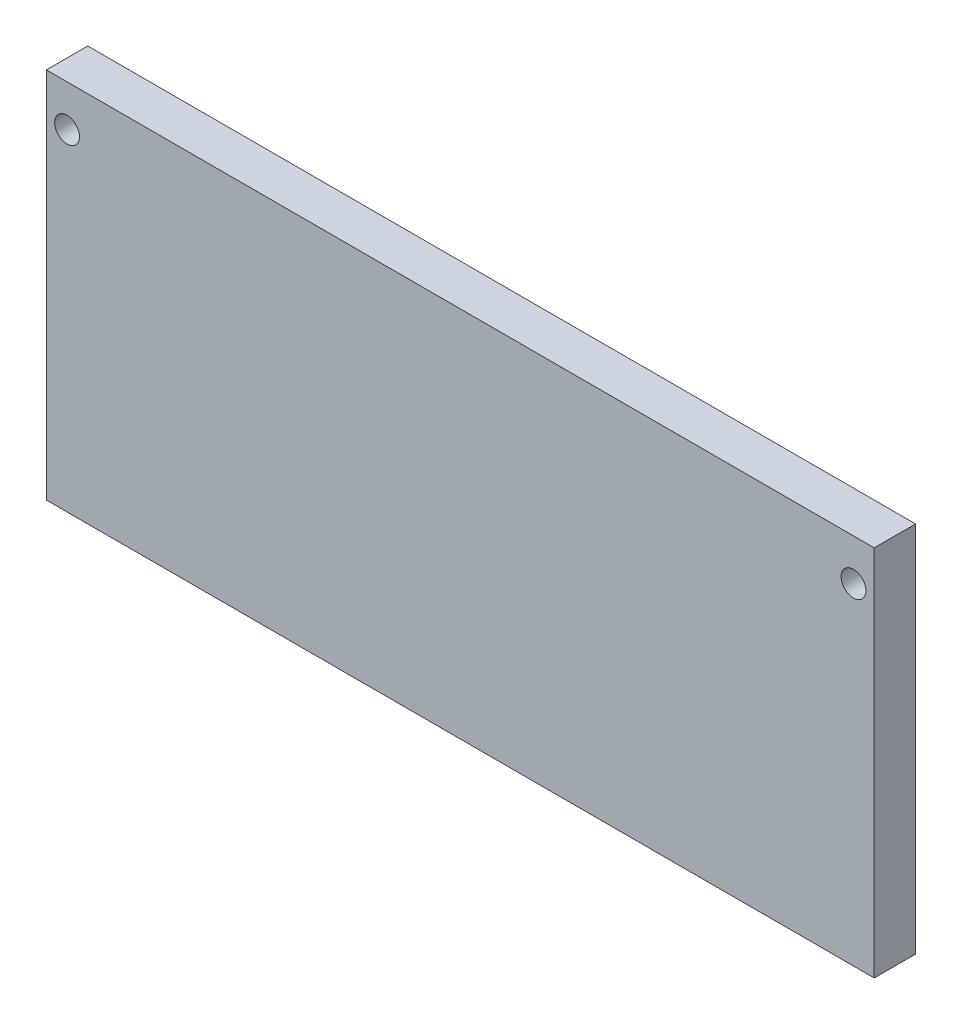
ISO-10303-21;
HEADER;
FILE_DESCRIPTION(('STEP AP214'),'2;1');
FILE_NAME('part.step','',(''),(''),'','','');
FILE_SCHEMA(('AUTOMOTIVE_DESIGN { 1 0 10303 214 1 1 1 1 }'));
ENDSEC;
DATA;
#1=APPLICATION_CONTEXT('core data for automotive mechanical design processes');
#2=APPLICATION_PROTOCOL_DEFINITION('international standard','automotive_design',2000,#1);
#3=PRODUCT_CONTEXT('',#1,'mechanical');
#4=PRODUCT('Part','Part','',(#3));
#5=PRODUCT_RELATED_PRODUCT_CATEGORY('part','',(#4));
#6=PRODUCT_DEFINITION_FORMATION('','',#4);
#7=PRODUCT_DEFINITION_CONTEXT('part definition',#1,'design');
#8=PRODUCT_DEFINITION('design','',#6,#7);
#9=PRODUCT_DEFINITION_SHAPE('','',#8);
#10=(LENGTH_UNIT() NAMED_UNIT(*) SI_UNIT(.MILLI.,.METRE.));
#11=(NAMED_UNIT(*) PLANE_ANGLE_UNIT() SI_UNIT($,.RADIAN.));
#12=(NAMED_UNIT(*) SI_UNIT($,.STERADIAN.) SOLID_ANGLE_UNIT());
#13=UNCERTAINTY_MEASURE_WITH_UNIT(LENGTH_MEASURE(1.E-05),#10,'distance_accuracy_value','');
#14=(GEOMETRIC_REPRESENTATION_CONTEXT(3) GLOBAL_UNCERTAINTY_ASSIGNED_CONTEXT((#13)) GLOBAL_UNIT_ASSIGNED_CONTEXT((#10,
#11,#12)) REPRESENTATION_CONTEXT('',''));
#15=CARTESIAN_POINT('',(0.,0.,0.));
#16=DIRECTION('',(0.,0.,1.));
#17=DIRECTION('',(1.,0.,0.));
#18=AXIS2_PLACEMENT_3D('',#15,#16,#17);
#19=CARTESIAN_POINT('',(0.,0.,5.));
#20=DIRECTION('',(0.,0.,-1.));
#21=DIRECTION('',(-1.,0.,0.));
#22=AXIS2_PLACEMENT_3D('',#19,#20,#21);
#23=PLANE('',#22);
#24=DIRECTION('',(0.,-1.,0.));
#25=VECTOR('',#24,1.);
#26=CARTESIAN_POINT('',(0.,0.,5.));
#27=LINE('',#26,#25);
#28=CARTESIAN_POINT('',(0.,45.,5.));
#29=VERTEX_POINT('',#28);
#30=CARTESIAN_POINT('',(0.,0.,5.));
#31=VERTEX_POINT('',#30);
#32=EDGE_CURVE('E92',#29,#31,#27,.T.);
#33=ORIENTED_EDGE('',*,*,#32,.T.);
#34=DIRECTION('',(1.,0.,0.));
#35=VECTOR('',#34,1.);
#36=CARTESIAN_POINT('',(0.,0.,5.));
#37=LINE('',#36,#35);
#38=CARTESIAN_POINT('',(100.,0.,5.));
#39=VERTEX_POINT('',#38);
#40=EDGE_CURVE('E87',#31,#39,#37,.T.);
#41=ORIENTED_EDGE('',*,*,#40,.T.);
#42=DIRECTION('',(0.,1.,0.));
#43=VECTOR('',#42,1.);
#44=CARTESIAN_POINT('',(100.,0.,5.));
#45=LINE('',#44,#43);
#46=CARTESIAN_POINT('',(100.,45.,5.));
#47=VERTEX_POINT('',#46);
#48=EDGE_CURVE('E90',#39,#47,#45,.T.);
#49=ORIENTED_EDGE('',*,*,#48,.T.);
#50=DIRECTION('',(-1.,0.,0.));
#51=VECTOR('',#50,1.);
#52=CARTESIAN_POINT('',(0.,45.,5.));
#53=LINE('',#52,#51);
#54=EDGE_CURVE('E57',#47,#29,#53,.T.);
#55=ORIENTED_EDGE('',*,*,#54,.T.);
#56=EDGE_LOOP('',(#33,#41,#49,#55));
#57=FACE_BOUND('',#56,.T.);
#58=CARTESIAN_POINT('',(2.5,40.,5.));
#59=DIRECTION('',(0.,0.,1.));
#60=DIRECTION('',(1.,0.,0.));
#61=AXIS2_PLACEMENT_3D('',#58,#59,#60);
#62=CIRCLE('',#61,1.5);
#63=CARTESIAN_POINT('',(4.,40.,5.));
#64=VERTEX_POINT('',#63);
#65=EDGE_CURVE('E112',#64,#64,#62,.T.);
#66=ORIENTED_EDGE('',*,*,#65,.F.);
#67=EDGE_LOOP('',(#66));
#68=FACE_BOUND('',#67,.T.);
#69=CARTESIAN_POINT('',(97.5,40.,5.));
#70=DIRECTION('',(0.,0.,1.));
#71=DIRECTION('',(1.,0.,0.));
#72=AXIS2_PLACEMENT_3D('',#69,#70,#71);
#73=CIRCLE('',#72,1.5);
#74=CARTESIAN_POINT('',(99.,40.,5.));
#75=VERTEX_POINT('',#74);
#76=EDGE_CURVE('E134',#75,#75,#73,.T.);
#77=ORIENTED_EDGE('',*,*,#76,.F.);
#78=EDGE_LOOP('',(#77));
#79=FACE_BOUND('',#78,.T.);
#80=ADVANCED_FACE('F39',(#57,#68,#79),#23,.F.);
#81=CARTESIAN_POINT('',(0.,0.,0.));
#82=DIRECTION('',(0.,0.,-1.));
#83=DIRECTION('',(-1.,0.,0.));
#84=AXIS2_PLACEMENT_3D('',#81,#82,#83);
#85=PLANE('',#84);
#86=CARTESIAN_POINT('',(2.5,40.,0.));
#87=DIRECTION('',(0.,0.,1.));
#88=DIRECTION('',(1.,0.,0.));
#89=AXIS2_PLACEMENT_3D('',#86,#87,#88);
#90=CIRCLE('',#89,1.5);
#91=CARTESIAN_POINT('',(4.,40.,0.));
#92=VERTEX_POINT('',#91);
#93=EDGE_CURVE('E130',#92,#92,#90,.T.);
#94=ORIENTED_EDGE('',*,*,#93,.T.);
#95=EDGE_LOOP('',(#94));
#96=FACE_BOUND('',#95,.T.);
#97=DIRECTION('',(0.,-1.,0.));
#98=VECTOR('',#97,1.);
#99=CARTESIAN_POINT('',(0.,0.,0.));
#100=LINE('',#99,#98);
#101=CARTESIAN_POINT('',(0.,45.,0.));
#102=VERTEX_POINT('',#101);
#103=CARTESIAN_POINT('',(0.,0.,0.));
#104=VERTEX_POINT('',#103);
#105=EDGE_CURVE('E108',#102,#104,#100,.T.);
#106=ORIENTED_EDGE('',*,*,#105,.F.);
#107=DIRECTION('',(-1.,0.,0.));
#108=VECTOR('',#107,1.);
#109=CARTESIAN_POINT('',(0.,45.,0.));
#110=LINE('',#109,#108);
#111=CARTESIAN_POINT('',(100.,45.,0.));
#112=VERTEX_POINT('',#111);
#113=EDGE_CURVE('E80',#112,#102,#110,.T.);
#114=ORIENTED_EDGE('',*,*,#113,.F.);
#115=DIRECTION('',(0.,1.,0.));
#116=VECTOR('',#115,1.);
#117=CARTESIAN_POINT('',(100.,0.,0.));
#118=LINE('',#117,#116);
#119=CARTESIAN_POINT('',(100.,0.,0.));
#120=VERTEX_POINT('',#119);
#121=EDGE_CURVE('E74',#120,#112,#118,.T.);
#122=ORIENTED_EDGE('',*,*,#121,.F.);
#123=DIRECTION('',(1.,0.,0.));
#124=VECTOR('',#123,1.);
#125=CARTESIAN_POINT('',(0.,0.,0.));
#126=LINE('',#125,#124);
#127=EDGE_CURVE('E97',#104,#120,#126,.T.);
#128=ORIENTED_EDGE('',*,*,#127,.F.);
#129=EDGE_LOOP('',(#106,#114,#122,#128));
#130=FACE_BOUND('',#129,.T.);
#131=CARTESIAN_POINT('',(97.5,40.,0.));
#132=DIRECTION('',(0.,0.,1.));
#133=DIRECTION('',(1.,0.,0.));
#134=AXIS2_PLACEMENT_3D('',#131,#132,#133);
#135=CIRCLE('',#134,1.5);
#136=CARTESIAN_POINT('',(99.,40.,0.));
#137=VERTEX_POINT('',#136);
#138=EDGE_CURVE('E138',#137,#137,#135,.T.);
#139=ORIENTED_EDGE('',*,*,#138,.T.);
#140=EDGE_LOOP('',(#139));
#141=FACE_BOUND('',#140,.T.);
#142=ADVANCED_FACE('F125',(#96,#130,#141),#85,.T.);
#143=CARTESIAN_POINT('',(0.,0.,5.));
#144=DIRECTION('',(1.,0.,0.));
#145=DIRECTION('',(0.,0.,-1.));
#146=AXIS2_PLACEMENT_3D('',#143,#144,#145);
#147=PLANE('',#146);
#148=ORIENTED_EDGE('',*,*,#105,.T.);
#149=DIRECTION('',(0.,0.,-1.));
#150=VECTOR('',#149,1.);
#151=CARTESIAN_POINT('',(0.,0.,5.));
#152=LINE('',#151,#150);
#153=EDGE_CURVE('E11',#31,#104,#152,.T.);
#154=ORIENTED_EDGE('',*,*,#153,.F.);
#155=ORIENTED_EDGE('',*,*,#32,.F.);
#156=DIRECTION('',(0.,0.,-1.));
#157=VECTOR('',#156,1.);
#158=CARTESIAN_POINT('',(0.,45.,5.));
#159=LINE('',#158,#157);
#160=EDGE_CURVE('E104',#29,#102,#159,.T.);
#161=ORIENTED_EDGE('',*,*,#160,.T.);
#162=EDGE_LOOP('',(#148,#154,#155,#161));
#163=FACE_BOUND('',#162,.T.);
#164=ADVANCED_FACE('F41',(#163),#147,.F.);
#165=CARTESIAN_POINT('',(0.,0.,5.));
#166=DIRECTION('',(0.,1.,0.));
#167=DIRECTION('',(0.,0.,1.));
#168=AXIS2_PLACEMENT_3D('',#165,#166,#167);
#169=PLANE('',#168);
#170=ORIENTED_EDGE('',*,*,#127,.T.);
#171=DIRECTION('',(0.,0.,-1.));
#172=VECTOR('',#171,1.);
#173=CARTESIAN_POINT('',(100.,0.,5.));
#174=LINE('',#173,#172);
#175=EDGE_CURVE('E49',#39,#120,#174,.T.);
#176=ORIENTED_EDGE('',*,*,#175,.F.);
#177=ORIENTED_EDGE('',*,*,#40,.F.);
#178=ORIENTED_EDGE('',*,*,#153,.T.);
#179=EDGE_LOOP('',(#170,#176,#177,#178));
#180=FACE_BOUND('',#179,.T.);
#181=ADVANCED_FACE('F96',(#180),#169,.F.);
#182=CARTESIAN_POINT('',(100.,0.,5.));
#183=DIRECTION('',(-1.,0.,0.));
#184=DIRECTION('',(0.,0.,1.));
#185=AXIS2_PLACEMENT_3D('',#182,#183,#184);
#186=PLANE('',#185);
#187=ORIENTED_EDGE('',*,*,#121,.T.);
#188=DIRECTION('',(0.,0.,-1.));
#189=VECTOR('',#188,1.);
#190=CARTESIAN_POINT('',(100.,45.,5.));
#191=LINE('',#190,#189);
#192=EDGE_CURVE('E99',#47,#112,#191,.T.);
#193=ORIENTED_EDGE('',*,*,#192,.F.);
#194=ORIENTED_EDGE('',*,*,#48,.F.);
#195=ORIENTED_EDGE('',*,*,#175,.T.);
#196=EDGE_LOOP('',(#187,#193,#194,#195));
#197=FACE_BOUND('',#196,.T.);
#198=ADVANCED_FACE('F100',(#197),#186,.F.);
#199=CARTESIAN_POINT('',(0.,45.,5.));
#200=DIRECTION('',(0.,-1.,0.));
#201=DIRECTION('',(0.,0.,-1.));
#202=AXIS2_PLACEMENT_3D('',#199,#200,#201);
#203=PLANE('',#202);
#204=ORIENTED_EDGE('',*,*,#113,.T.);
#205=ORIENTED_EDGE('',*,*,#160,.F.);
#206=ORIENTED_EDGE('',*,*,#54,.F.);
#207=ORIENTED_EDGE('',*,*,#192,.T.);
#208=EDGE_LOOP('',(#204,#205,#206,#207));
#209=FACE_BOUND('',#208,.T.);
#210=ADVANCED_FACE('F122',(#209),#203,.F.);
#211=CARTESIAN_POINT('',(2.5,40.,5.));
#212=DIRECTION('',(0.,0.,-1.));
#213=DIRECTION('',(-1.,0.,0.));
#214=AXIS2_PLACEMENT_3D('',#211,#212,#213);
#215=CYLINDRICAL_SURFACE('',#214,1.5);
#216=ORIENTED_EDGE('',*,*,#65,.T.);
#217=EDGE_LOOP('',(#216));
#218=FACE_BOUND('',#217,.T.);
#219=ORIENTED_EDGE('',*,*,#93,.F.);
#220=EDGE_LOOP('',(#219));
#221=FACE_BOUND('',#220,.T.);
#222=ADVANCED_FACE('F157',(#218,#221),#215,.F.);
#223=CARTESIAN_POINT('',(97.5,40.,5.));
#224=DIRECTION('',(0.,0.,-1.));
#225=DIRECTION('',(-1.,0.,0.));
#226=AXIS2_PLACEMENT_3D('',#223,#224,#225);
#227=CYLINDRICAL_SURFACE('',#226,1.5);
#228=ORIENTED_EDGE('',*,*,#76,.T.);
#229=EDGE_LOOP('',(#228));
#230=FACE_BOUND('',#229,.T.);
#231=ORIENTED_EDGE('',*,*,#138,.F.);
#232=EDGE_LOOP('',(#231));
#233=FACE_BOUND('',#232,.T.);
#234=ADVANCED_FACE('F146',(#230,#233),#227,.F.);
#235=CLOSED_SHELL('',(#80,#142,#164,#181,#198,#210,#222,#234));
#236=MANIFOLD_SOLID_BREP('B2',#235);
#237=ADVANCED_BREP_SHAPE_REPRESENTATION('',(#18,#236),#14);
#238=SHAPE_DEFINITION_REPRESENTATION(#9,#237);
ENDSEC;
END-ISO-10303-21;
